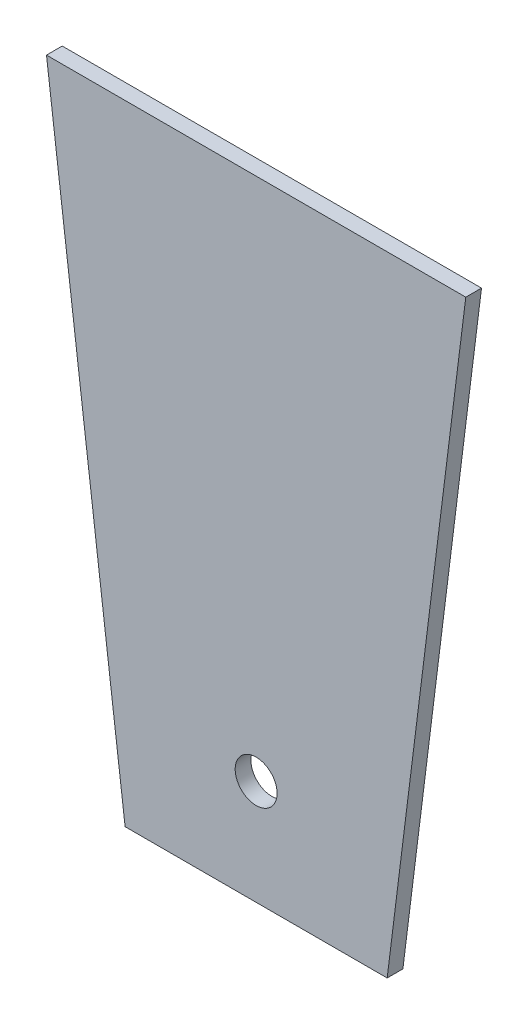
ISO-10303-21;
HEADER;
FILE_DESCRIPTION(('STEP AP214'),'2;1');
FILE_NAME('part.step','',(''),(''),'','','');
FILE_SCHEMA(('AUTOMOTIVE_DESIGN { 1 0 10303 214 1 1 1 1 }'));
ENDSEC;
DATA;
#1=APPLICATION_CONTEXT('core data for automotive mechanical design processes');
#2=APPLICATION_PROTOCOL_DEFINITION('international standard','automotive_design',2000,#1);
#3=PRODUCT_CONTEXT('',#1,'mechanical');
#4=PRODUCT('Part','Part','',(#3));
#5=PRODUCT_RELATED_PRODUCT_CATEGORY('part','',(#4));
#6=PRODUCT_DEFINITION_FORMATION('','',#4);
#7=PRODUCT_DEFINITION_CONTEXT('part definition',#1,'design');
#8=PRODUCT_DEFINITION('design','',#6,#7);
#9=PRODUCT_DEFINITION_SHAPE('','',#8);
#10=(LENGTH_UNIT() NAMED_UNIT(*) SI_UNIT(.MILLI.,.METRE.));
#11=(NAMED_UNIT(*) PLANE_ANGLE_UNIT() SI_UNIT($,.RADIAN.));
#12=(NAMED_UNIT(*) SI_UNIT($,.STERADIAN.) SOLID_ANGLE_UNIT());
#13=UNCERTAINTY_MEASURE_WITH_UNIT(LENGTH_MEASURE(1.E-05),#10,'distance_accuracy_value','');
#14=(GEOMETRIC_REPRESENTATION_CONTEXT(3) GLOBAL_UNCERTAINTY_ASSIGNED_CONTEXT((#13)) GLOBAL_UNIT_ASSIGNED_CONTEXT((#10,
#11,#12)) REPRESENTATION_CONTEXT('',''));
#15=CARTESIAN_POINT('',(0.,0.,0.));
#16=DIRECTION('',(0.,0.,1.));
#17=DIRECTION('',(1.,0.,0.));
#18=AXIS2_PLACEMENT_3D('',#15,#16,#17);
#19=CARTESIAN_POINT('',(0.,0.,3.));
#20=DIRECTION('',(0.,0.,1.));
#21=DIRECTION('',(1.,0.,0.));
#22=AXIS2_PLACEMENT_3D('',#19,#20,#21);
#23=PLANE('',#22);
#24=DIRECTION('',(0.124034734589209,-0.992277876713668,0.));
#25=VECTOR('',#24,1.);
#26=CARTESIAN_POINT('',(-40.,120.,3.));
#27=LINE('',#26,#25);
#28=CARTESIAN_POINT('',(-40.,120.,3.));
#29=VERTEX_POINT('',#28);
#30=CARTESIAN_POINT('',(-25.,0.,3.));
#31=VERTEX_POINT('',#30);
#32=EDGE_CURVE('E92',#29,#31,#27,.T.);
#33=ORIENTED_EDGE('',*,*,#32,.T.);
#34=DIRECTION('',(1.,0.,0.));
#35=VECTOR('',#34,1.);
#36=CARTESIAN_POINT('',(-25.,0.,3.));
#37=LINE('',#36,#35);
#38=CARTESIAN_POINT('',(25.,0.,3.));
#39=VERTEX_POINT('',#38);
#40=EDGE_CURVE('E87',#31,#39,#37,.T.);
#41=ORIENTED_EDGE('',*,*,#40,.T.);
#42=DIRECTION('',(0.124034734589208,0.992277876713668,0.));
#43=VECTOR('',#42,1.);
#44=CARTESIAN_POINT('',(40.,120.,3.));
#45=LINE('',#44,#43);
#46=CARTESIAN_POINT('',(40.,120.,3.));
#47=VERTEX_POINT('',#46);
#48=EDGE_CURVE('E90',#39,#47,#45,.T.);
#49=ORIENTED_EDGE('',*,*,#48,.T.);
#50=DIRECTION('',(-1.,0.,0.));
#51=VECTOR('',#50,1.);
#52=CARTESIAN_POINT('',(-40.,120.,3.));
#53=LINE('',#52,#51);
#54=EDGE_CURVE('E57',#47,#29,#53,.T.);
#55=ORIENTED_EDGE('',*,*,#54,.T.);
#56=EDGE_LOOP('',(#33,#41,#49,#55));
#57=FACE_BOUND('',#56,.T.);
#58=CARTESIAN_POINT('',(0.,20.,3.));
#59=DIRECTION('',(0.,0.,1.));
#60=DIRECTION('',(1.,0.,0.));
#61=AXIS2_PLACEMENT_3D('',#58,#59,#60);
#62=CIRCLE('',#61,4.);
#63=CARTESIAN_POINT('',(4.,20.,3.));
#64=VERTEX_POINT('',#63);
#65=EDGE_CURVE('E112',#64,#64,#62,.T.);
#66=ORIENTED_EDGE('',*,*,#65,.F.);
#67=EDGE_LOOP('',(#66));
#68=FACE_BOUND('',#67,.T.);
#69=ADVANCED_FACE('F39',(#57,#68),#23,.T.);
#70=CARTESIAN_POINT('',(0.,0.,0.));
#71=DIRECTION('',(0.,0.,1.));
#72=DIRECTION('',(1.,0.,0.));
#73=AXIS2_PLACEMENT_3D('',#70,#71,#72);
#74=PLANE('',#73);
#75=DIRECTION('',(0.124034734589209,-0.992277876713668,0.));
#76=VECTOR('',#75,1.);
#77=CARTESIAN_POINT('',(-40.,120.,0.));
#78=LINE('',#77,#76);
#79=CARTESIAN_POINT('',(-40.,120.,0.));
#80=VERTEX_POINT('',#79);
#81=CARTESIAN_POINT('',(-25.,0.,0.));
#82=VERTEX_POINT('',#81);
#83=EDGE_CURVE('E108',#80,#82,#78,.T.);
#84=ORIENTED_EDGE('',*,*,#83,.F.);
#85=DIRECTION('',(-1.,0.,0.));
#86=VECTOR('',#85,1.);
#87=CARTESIAN_POINT('',(-40.,120.,0.));
#88=LINE('',#87,#86);
#89=CARTESIAN_POINT('',(40.,120.,0.));
#90=VERTEX_POINT('',#89);
#91=EDGE_CURVE('E80',#90,#80,#88,.T.);
#92=ORIENTED_EDGE('',*,*,#91,.F.);
#93=DIRECTION('',(0.124034734589208,0.992277876713668,0.));
#94=VECTOR('',#93,1.);
#95=CARTESIAN_POINT('',(40.,120.,0.));
#96=LINE('',#95,#94);
#97=CARTESIAN_POINT('',(25.,0.,0.));
#98=VERTEX_POINT('',#97);
#99=EDGE_CURVE('E74',#98,#90,#96,.T.);
#100=ORIENTED_EDGE('',*,*,#99,.F.);
#101=DIRECTION('',(1.,0.,0.));
#102=VECTOR('',#101,1.);
#103=CARTESIAN_POINT('',(-25.,0.,0.));
#104=LINE('',#103,#102);
#105=EDGE_CURVE('E97',#82,#98,#104,.T.);
#106=ORIENTED_EDGE('',*,*,#105,.F.);
#107=EDGE_LOOP('',(#84,#92,#100,#106));
#108=FACE_BOUND('',#107,.T.);
#109=CARTESIAN_POINT('',(0.,20.,0.));
#110=DIRECTION('',(0.,0.,1.));
#111=DIRECTION('',(1.,0.,0.));
#112=AXIS2_PLACEMENT_3D('',#109,#110,#111);
#113=CIRCLE('',#112,4.);
#114=CARTESIAN_POINT('',(4.,20.,0.));
#115=VERTEX_POINT('',#114);
#116=EDGE_CURVE('E130',#115,#115,#113,.T.);
#117=ORIENTED_EDGE('',*,*,#116,.T.);
#118=EDGE_LOOP('',(#117));
#119=FACE_BOUND('',#118,.T.);
#120=ADVANCED_FACE('F125',(#108,#119),#74,.F.);
#121=CARTESIAN_POINT('',(-40.,120.,3.));
#122=DIRECTION('',(0.992277876713668,0.124034734589209,0.));
#123=DIRECTION('',(-0.124034734589209,0.992277876713668,0.));
#124=AXIS2_PLACEMENT_3D('',#121,#122,#123);
#125=PLANE('',#124);
#126=ORIENTED_EDGE('',*,*,#83,.T.);
#127=DIRECTION('',(0.,0.,-1.));
#128=VECTOR('',#127,1.);
#129=CARTESIAN_POINT('',(-25.,0.,3.));
#130=LINE('',#129,#128);
#131=EDGE_CURVE('E11',#31,#82,#130,.T.);
#132=ORIENTED_EDGE('',*,*,#131,.F.);
#133=ORIENTED_EDGE('',*,*,#32,.F.);
#134=DIRECTION('',(0.,0.,-1.));
#135=VECTOR('',#134,1.);
#136=CARTESIAN_POINT('',(-40.,120.,3.));
#137=LINE('',#136,#135);
#138=EDGE_CURVE('E104',#29,#80,#137,.T.);
#139=ORIENTED_EDGE('',*,*,#138,.T.);
#140=EDGE_LOOP('',(#126,#132,#133,#139));
#141=FACE_BOUND('',#140,.T.);
#142=ADVANCED_FACE('F41',(#141),#125,.F.);
#143=CARTESIAN_POINT('',(-25.,0.,3.));
#144=DIRECTION('',(0.,1.,0.));
#145=DIRECTION('',(-1.,0.,0.));
#146=AXIS2_PLACEMENT_3D('',#143,#144,#145);
#147=PLANE('',#146);
#148=ORIENTED_EDGE('',*,*,#105,.T.);
#149=DIRECTION('',(0.,0.,-1.));
#150=VECTOR('',#149,1.);
#151=CARTESIAN_POINT('',(25.,0.,3.));
#152=LINE('',#151,#150);
#153=EDGE_CURVE('E49',#39,#98,#152,.T.);
#154=ORIENTED_EDGE('',*,*,#153,.F.);
#155=ORIENTED_EDGE('',*,*,#40,.F.);
#156=ORIENTED_EDGE('',*,*,#131,.T.);
#157=EDGE_LOOP('',(#148,#154,#155,#156));
#158=FACE_BOUND('',#157,.T.);
#159=ADVANCED_FACE('F96',(#158),#147,.F.);
#160=CARTESIAN_POINT('',(40.,120.,3.));
#161=DIRECTION('',(-0.992277876713668,0.124034734589208,0.));
#162=DIRECTION('',(-0.124034734589208,-0.992277876713668,0.));
#163=AXIS2_PLACEMENT_3D('',#160,#161,#162);
#164=PLANE('',#163);
#165=ORIENTED_EDGE('',*,*,#99,.T.);
#166=DIRECTION('',(0.,0.,-1.));
#167=VECTOR('',#166,1.);
#168=CARTESIAN_POINT('',(40.,120.,3.));
#169=LINE('',#168,#167);
#170=EDGE_CURVE('E99',#47,#90,#169,.T.);
#171=ORIENTED_EDGE('',*,*,#170,.F.);
#172=ORIENTED_EDGE('',*,*,#48,.F.);
#173=ORIENTED_EDGE('',*,*,#153,.T.);
#174=EDGE_LOOP('',(#165,#171,#172,#173));
#175=FACE_BOUND('',#174,.T.);
#176=ADVANCED_FACE('F100',(#175),#164,.F.);
#177=CARTESIAN_POINT('',(-40.,120.,3.));
#178=DIRECTION('',(0.,-1.,0.));
#179=DIRECTION('',(1.,0.,0.));
#180=AXIS2_PLACEMENT_3D('',#177,#178,#179);
#181=PLANE('',#180);
#182=ORIENTED_EDGE('',*,*,#91,.T.);
#183=ORIENTED_EDGE('',*,*,#138,.F.);
#184=ORIENTED_EDGE('',*,*,#54,.F.);
#185=ORIENTED_EDGE('',*,*,#170,.T.);
#186=EDGE_LOOP('',(#182,#183,#184,#185));
#187=FACE_BOUND('',#186,.T.);
#188=ADVANCED_FACE('F122',(#187),#181,.F.);
#189=CARTESIAN_POINT('',(0.,20.,3.));
#190=DIRECTION('',(0.,0.,-1.));
#191=DIRECTION('',(-1.,0.,0.));
#192=AXIS2_PLACEMENT_3D('',#189,#190,#191);
#193=CYLINDRICAL_SURFACE('',#192,4.);
#194=ORIENTED_EDGE('',*,*,#65,.T.);
#195=EDGE_LOOP('',(#194));
#196=FACE_BOUND('',#195,.T.);
#197=ORIENTED_EDGE('',*,*,#116,.F.);
#198=EDGE_LOOP('',(#197));
#199=FACE_BOUND('',#198,.T.);
#200=ADVANCED_FACE('F138',(#196,#199),#193,.F.);
#201=CLOSED_SHELL('',(#69,#120,#142,#159,#176,#188,#200));
#202=MANIFOLD_SOLID_BREP('B2',#201);
#203=ADVANCED_BREP_SHAPE_REPRESENTATION('',(#18,#202),#14);
#204=SHAPE_DEFINITION_REPRESENTATION(#9,#203);
ENDSEC;
END-ISO-10303-21;
